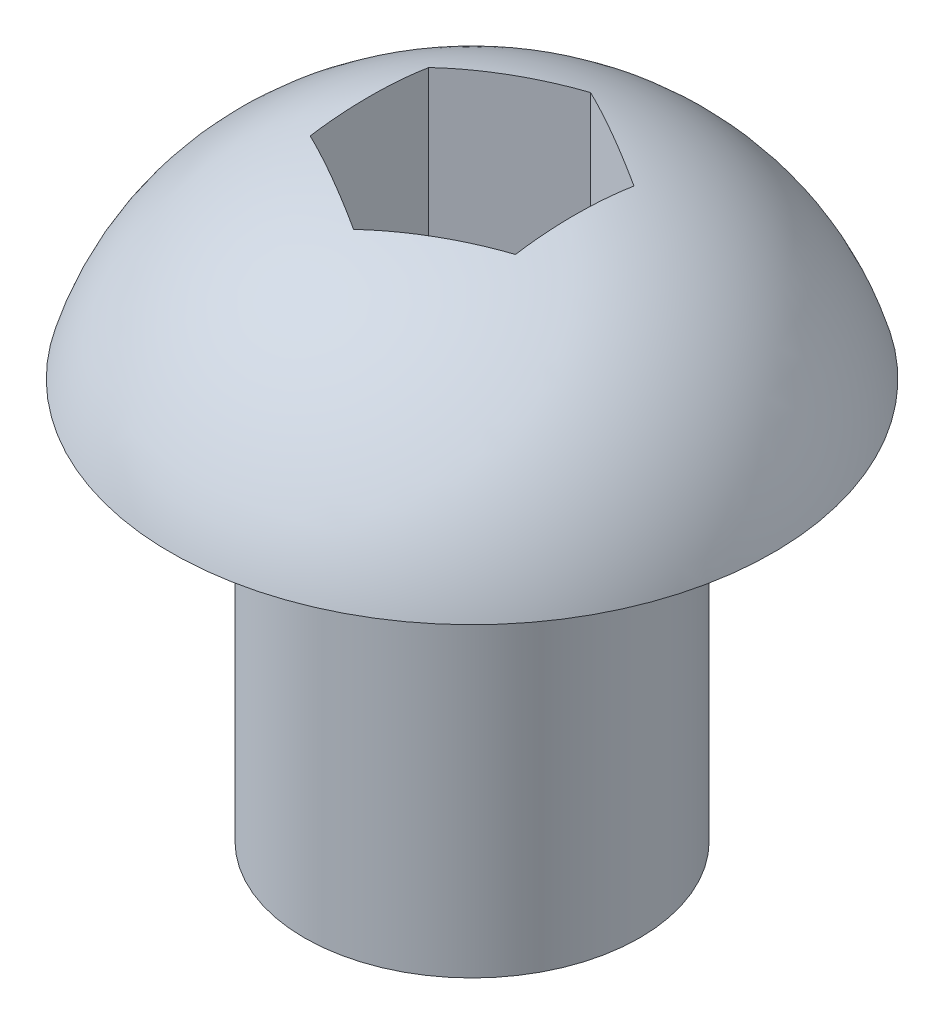
ISO-10303-21;
HEADER;
FILE_DESCRIPTION(('STEP AP214'),'2;1');
FILE_NAME('part.step','',(''),(''),'','','');
FILE_SCHEMA(('AUTOMOTIVE_DESIGN { 1 0 10303 214 1 1 1 1 }'));
ENDSEC;
DATA;
#1=APPLICATION_CONTEXT('core data for automotive mechanical design processes');
#2=APPLICATION_PROTOCOL_DEFINITION('international standard','automotive_design',2000,#1);
#3=PRODUCT_CONTEXT('',#1,'mechanical');
#4=PRODUCT('Part','Part','',(#3));
#5=PRODUCT_RELATED_PRODUCT_CATEGORY('part','',(#4));
#6=PRODUCT_DEFINITION_FORMATION('','',#4);
#7=PRODUCT_DEFINITION_CONTEXT('part definition',#1,'design');
#8=PRODUCT_DEFINITION('design','',#6,#7);
#9=PRODUCT_DEFINITION_SHAPE('','',#8);
#10=(LENGTH_UNIT() NAMED_UNIT(*) SI_UNIT(.MILLI.,.METRE.));
#11=(NAMED_UNIT(*) PLANE_ANGLE_UNIT() SI_UNIT($,.RADIAN.));
#12=(NAMED_UNIT(*) SI_UNIT($,.STERADIAN.) SOLID_ANGLE_UNIT());
#13=UNCERTAINTY_MEASURE_WITH_UNIT(LENGTH_MEASURE(1.E-05),#10,'distance_accuracy_value','');
#14=(GEOMETRIC_REPRESENTATION_CONTEXT(3) GLOBAL_UNCERTAINTY_ASSIGNED_CONTEXT((#13)) GLOBAL_UNIT_ASSIGNED_CONTEXT((#10,
#11,#12)) REPRESENTATION_CONTEXT('',''));
#15=CARTESIAN_POINT('',(0.,0.,0.));
#16=DIRECTION('',(0.,0.,1.));
#17=DIRECTION('',(1.,0.,0.));
#18=AXIS2_PLACEMENT_3D('',#15,#16,#17);
#19=CARTESIAN_POINT('',(2.4257,0.,0.));
#20=DIRECTION('',(0.,-1.,0.));
#21=DIRECTION('',(0.,0.,-1.));
#22=AXIS2_PLACEMENT_3D('',#19,#20,#21);
#23=PLANE('',#22);
#24=CARTESIAN_POINT('',(0.,0.,0.));
#25=DIRECTION('',(0.,-1.,0.));
#26=DIRECTION('',(0.,0.,-1.));
#27=AXIS2_PLACEMENT_3D('',#24,#25,#26);
#28=CIRCLE('',#27,2.4257);
#29=CARTESIAN_POINT('',(0.,0.,-2.4257));
#30=VERTEX_POINT('',#29);
#31=EDGE_CURVE('E123',#30,#30,#28,.T.);
#32=ORIENTED_EDGE('',*,*,#31,.T.);
#33=EDGE_LOOP('',(#32));
#34=FACE_BOUND('',#33,.T.);
#35=ADVANCED_FACE('F36',(#34),#23,.T.);
#36=CARTESIAN_POINT('',(0.,4.69417871693487,0.));
#37=DIRECTION('',(0.,-1.,0.));
#38=DIRECTION('',(0.,0.,-1.));
#39=AXIS2_PLACEMENT_3D('',#36,#37,#38);
#40=DEGENERATE_TOROIDAL_SURFACE('',#39,0.490735937500002,4.01802128306513,.T.);
#41=CARTESIAN_POINT('',(-1.48500055478842,8.52126819752041,0.857134529946162));
#42=CARTESIAN_POINT('',(-1.42345605284962,8.53263218673534,0.892667264707669));
#43=CARTESIAN_POINT('',(-1.36170184009149,8.54243185809129,0.92832107606717));
#44=CARTESIAN_POINT('',(-1.23790653077806,8.55905516785311,0.999794331223692));
#45=CARTESIAN_POINT('',(-1.17586550058913,8.56587946300035,1.03561373670407));
#46=CARTESIAN_POINT('',(-1.05196514152997,8.576677839765,1.10714764235957));
#47=CARTESIAN_POINT('',(-0.990106871712011,8.58066835550609,1.14286153109057));
#48=CARTESIAN_POINT('',(-0.866299165788773,8.58597553249123,1.2143419434331));
#49=CARTESIAN_POINT('',(-0.804349721591492,8.58729194003748,1.25010847171655));
#50=CARTESIAN_POINT('',(-0.680450833196929,8.58729194003748,1.32164152828345));
#51=CARTESIAN_POINT('',(-0.618501388999647,8.58597553249123,1.3574080565669));
#52=CARTESIAN_POINT('',(-0.494693683076409,8.58066835550609,1.42888846890943));
#53=CARTESIAN_POINT('',(-0.432835413258449,8.576677839765,1.46460235764043));
#54=CARTESIAN_POINT('',(-0.308935054199295,8.56587946300035,1.53613626329593));
#55=CARTESIAN_POINT('',(-0.246894024010362,8.55905516785311,1.57195566877631));
#56=CARTESIAN_POINT('',(-0.123098714696933,8.54243185809129,1.64342892393283));
#57=CARTESIAN_POINT('',(-0.0613445019388007,8.53263218673534,1.67908273529233));
#58=CARTESIAN_POINT('',(0.000199999999999774,8.52126819752041,1.71461547005384));
#59=B_SPLINE_CURVE_WITH_KNOTS('',3,(#41,#42,#43,#44,#45,#46,#47,#48,#49,#50,#51,#52,#53,#54,#55,
#56,#57,#58),.UNSPECIFIED.,.F.,.F.,(4,2,2,2,2,2,2,2,4),(0.,0.215876085763593,0.431704498019962,
0.646270787810531,0.860857432969198,1.07544407812787,1.29001036791843,1.5058387801748,
1.7217148659384),.UNSPECIFIED.);
#60=CARTESIAN_POINT('',(-1.48480055478842,8.52130512593453,0.857249999999999));
#61=VERTEX_POINT('',#60);
#62=CARTESIAN_POINT('',(0.,8.52130512593913,1.7145));
#63=VERTEX_POINT('',#62);
#64=EDGE_CURVE('E11',#61,#63,#59,.T.);
#65=ORIENTED_EDGE('',*,*,#64,.F.);
#66=CARTESIAN_POINT('',(-1.48480055478842,6.2540860320131,-3.92194184205145));
#67=CARTESIAN_POINT('',(-1.48480055478842,6.35234420308012,-3.87769530561394));
#68=CARTESIAN_POINT('',(-1.48480055478842,6.44871000577097,-3.82925660286901));
#69=CARTESIAN_POINT('',(-1.48480055478842,6.63699181672535,-3.72441151031348));
#70=CARTESIAN_POINT('',(-1.48480055478842,6.7289083151432,-3.66800600085476));
#71=CARTESIAN_POINT('',(-1.48480055478842,6.90764435131329,-3.54763674639004));
#72=CARTESIAN_POINT('',(-1.48480055478842,6.99446412248751,-3.48367334792815));
#73=CARTESIAN_POINT('',(-1.48480055478842,7.16241359392092,-3.34866912919352));
#74=CARTESIAN_POINT('',(-1.48480055478842,7.24354327974247,-3.27762829096406));
#75=CARTESIAN_POINT('',(-1.48480055478842,7.39954905135694,-3.12901585724702));
#76=CARTESIAN_POINT('',(-1.48480055478842,7.47442641794356,-3.05144560588626));
#77=CARTESIAN_POINT('',(-1.48480055478842,7.61748671327265,-2.89031356794658));
#78=CARTESIAN_POINT('',(-1.48480055478842,7.68566730065923,-2.80674970339852));
#79=CARTESIAN_POINT('',(-1.48480055478842,7.81478961333397,-2.63441221203854));
#80=CARTESIAN_POINT('',(-1.48480055478842,7.87574251005016,-2.54564695064664));
#81=CARTESIAN_POINT('',(-1.48480055478842,7.99020713516254,-2.3634405277781));
#82=CARTESIAN_POINT('',(-1.48480055478842,8.0437185350078,-2.26999916009334));
#83=CARTESIAN_POINT('',(-1.48480055478842,8.14405576080886,-2.07722725655483));
#84=CARTESIAN_POINT('',(-1.48480055478842,8.19072747066138,-1.97781655900659));
#85=CARTESIAN_POINT('',(-1.48480055478842,8.27596140025615,-1.77561304753442));
#86=CARTESIAN_POINT('',(-1.48480055478842,8.31452551799499,-1.67282103171182));
#87=CARTESIAN_POINT('',(-1.48480055478842,8.38368125682067,-1.46432511616571));
#88=CARTESIAN_POINT('',(-1.48480055478842,8.41425367291229,-1.35861486484635));
#89=CARTESIAN_POINT('',(-1.48480055478842,8.4675366873076,-1.14524186718944));
#90=CARTESIAN_POINT('',(-1.48480055478842,8.49024677345088,-1.03757899413663));
#91=CARTESIAN_POINT('',(-1.48480055478842,8.53579824265424,-0.777770909723741));
#92=CARTESIAN_POINT('',(-1.48480055478842,8.55508441996515,-0.624999157088173));
#93=CARTESIAN_POINT('',(-1.48480055478842,8.58069238732413,-0.318319132229824));
#94=CARTESIAN_POINT('',(-1.48480055478842,8.58700440474377,-0.16441009086498));
#95=CARTESIAN_POINT('',(-1.48480055478842,8.58756062004907,0.143467913610971));
#96=CARTESIAN_POINT('',(-1.48480055478842,8.58180180837516,0.297436882094128));
#97=CARTESIAN_POINT('',(-1.48480055478842,8.5573632040929,0.604295470334223));
#98=CARTESIAN_POINT('',(-1.48480055478842,8.53869241737493,0.757185767408363));
#99=CARTESIAN_POINT('',(-1.48480055478842,8.49280269894119,1.02568808548143));
#100=CARTESIAN_POINT('',(-1.48480055478842,8.46852863453429,1.14180332902047));
#101=CARTESIAN_POINT('',(-1.48480055478842,8.41083395035771,1.37175274264053));
#102=CARTESIAN_POINT('',(-1.48480055478842,8.37741393762242,1.48558706357286));
#103=CARTESIAN_POINT('',(-1.48480055478842,8.30124772969897,1.7097869594038));
#104=CARTESIAN_POINT('',(-1.48480055478842,8.25852494987165,1.82016046140334));
#105=CARTESIAN_POINT('',(-1.48480055478842,8.16366833042843,2.0368369375452));
#106=CARTESIAN_POINT('',(-1.48480055478842,8.11153157622265,2.1431386386582));
#107=CARTESIAN_POINT('',(-1.48480055478842,7.99774836729465,2.35123648794121));
#108=CARTESIAN_POINT('',(-1.48480055478842,7.9360548668423,2.45300695367613));
#109=CARTESIAN_POINT('',(-1.48480055478842,7.80371112731108,2.65054561514294));
#110=CARTESIAN_POINT('',(-1.48480055478842,7.7330611437586,2.74631398199687));
#111=CARTESIAN_POINT('',(-1.48480055478842,7.58319624413255,2.93110086695805));
#112=CARTESIAN_POINT('',(-1.48480055478842,7.50397122511524,3.02011120821785));
#113=CARTESIAN_POINT('',(-1.48480055478842,7.33767899789258,3.19041385508771));
#114=CARTESIAN_POINT('',(-1.48480055478842,7.25061283339597,3.2717071849333));
#115=CARTESIAN_POINT('',(-1.48480055478842,7.02324107567918,3.46499804387016));
#116=CARTESIAN_POINT('',(-1.48480055478842,6.87831734219661,3.57167512033847));
#117=CARTESIAN_POINT('',(-1.48480055478842,6.6510798702109,3.71545560019411));
#118=CARTESIAN_POINT('',(-1.48480055478842,6.57375147121738,3.76064977298666));
#119=CARTESIAN_POINT('',(-1.48480055478842,6.41608849913641,3.84549899940108));
#120=CARTESIAN_POINT('',(-1.48480055478842,6.335753185086,3.88515267618989));
#121=CARTESIAN_POINT('',(-1.48480055478842,6.2540860320131,3.92194184205145));
#122=B_SPLINE_CURVE_WITH_KNOTS('',3,(#66,#67,#68,#69,#70,#71,#72,#73,#74,#75,#76,#77,#78,#79,
#80,#81,#82,#83,#84,#85,#86,#87,#88,#89,#90,#91,#92,#93,#94,#95,#96,#97,#98,#99,#100,#101,#102,
#103,#104,#105,#106,#107,#108,#109,#110,#111,#112,#113,#114,#115,#116,#117,#118,#119,#120,#121),
.UNSPECIFIED.,.F.,.F.,(4,2,2,2,2,2,2,2,2,2,2,2,2,2,2,2,2,2,2,2,2,2,2,2,2,2,2,4),(0.,
0.323179929253924,0.646324174223882,0.969453608138817,1.29258386191154,1.61564775890988,
1.93882420777613,2.26149444395808,2.58417892189442,2.9132805060936,3.24230496123598,
3.57211297909923,3.9019424769617,4.36322949108446,4.82486383691124,5.28661329341565,
5.74804101165651,6.10357988249299,6.45909516124311,6.81372573280824,7.16846628772878,
7.525012160703,7.88154786379453,8.23850829962181,8.59542129166232,9.13322783117922,
9.40174347220414,9.67032572209705),.UNSPECIFIED.);
#123=CARTESIAN_POINT('',(-1.48480055478842,8.52130512593913,-0.85725));
#124=VERTEX_POINT('',#123);
#125=EDGE_CURVE('E48',#124,#61,#122,.T.);
#126=ORIENTED_EDGE('',*,*,#125,.F.);
#127=CARTESIAN_POINT('',(0.00020000000000035,8.5212681975204,-1.71461547005384));
#128=CARTESIAN_POINT('',(-0.0613445019387998,8.53263218673534,-1.67908273529233));
#129=CARTESIAN_POINT('',(-0.123098714696932,8.54243185809129,-1.64342892393283));
#130=CARTESIAN_POINT('',(-0.246894024010361,8.55905516785311,-1.57195566877631));
#131=CARTESIAN_POINT('',(-0.308935054199294,8.56587946300035,-1.53613626329593));
#132=CARTESIAN_POINT('',(-0.432835413258449,8.576677839765,-1.46460235764043));
#133=CARTESIAN_POINT('',(-0.494693683076409,8.58066835550609,-1.42888846890943));
#134=CARTESIAN_POINT('',(-0.618501388999647,8.58597553249123,-1.3574080565669));
#135=CARTESIAN_POINT('',(-0.680450833196928,8.58729194003748,-1.32164152828345));
#136=CARTESIAN_POINT('',(-0.804349721591491,8.58729194003748,-1.25010847171655));
#137=CARTESIAN_POINT('',(-0.866299165788773,8.58597553249123,-1.2143419434331));
#138=CARTESIAN_POINT('',(-0.990106871712011,8.58066835550609,-1.14286153109057));
#139=CARTESIAN_POINT('',(-1.05196514152997,8.576677839765,-1.10714764235957));
#140=CARTESIAN_POINT('',(-1.17586550058913,8.56587946300035,-1.03561373670407));
#141=CARTESIAN_POINT('',(-1.23790653077806,8.55905516785311,-0.999794331223692));
#142=CARTESIAN_POINT('',(-1.36170184009149,8.54243185809129,-0.928321076067171));
#143=CARTESIAN_POINT('',(-1.42345605284962,8.53263218673534,-0.89266726470767));
#144=CARTESIAN_POINT('',(-1.48500055478842,8.5212681975204,-0.857134529946162));
#145=B_SPLINE_CURVE_WITH_KNOTS('',3,(#127,#128,#129,#130,#131,#132,#133,#134,#135,#136,#137,
#138,#139,#140,#141,#142,#143,#144),.UNSPECIFIED.,.F.,.F.,(4,2,2,2,2,2,2,2,4),(0.,
0.215876085763593,0.431704498019962,0.646270787810531,0.860857432969198,1.07544407812787,
1.29001036791843,1.5058387801748,1.7217148659384),.UNSPECIFIED.);
#146=CARTESIAN_POINT('',(0.,8.52130512593913,-1.7145));
#147=VERTEX_POINT('',#146);
#148=EDGE_CURVE('E287',#147,#124,#145,.T.);
#149=ORIENTED_EDGE('',*,*,#148,.F.);
#150=CARTESIAN_POINT('',(1.48500055478842,8.52126819752041,-0.857134529946163));
#151=CARTESIAN_POINT('',(1.42345605284962,8.53263218673534,-0.892667264707671));
#152=CARTESIAN_POINT('',(1.36170184009149,8.54243185809129,-0.928321076067172));
#153=CARTESIAN_POINT('',(1.23790653077806,8.55905516785311,-0.999794331223693));
#154=CARTESIAN_POINT('',(1.17586550058912,8.56587946300035,-1.03561373670407));
#155=CARTESIAN_POINT('',(1.05196514152997,8.576677839765,-1.10714764235957));
#156=CARTESIAN_POINT('',(0.99010687171201,8.58066835550609,-1.14286153109057));
#157=CARTESIAN_POINT('',(0.866299165788772,8.58597553249123,-1.2143419434331));
#158=CARTESIAN_POINT('',(0.804349721591491,8.58729194003748,-1.25010847171655));
#159=CARTESIAN_POINT('',(0.680450833196928,8.58729194003748,-1.32164152828345));
#160=CARTESIAN_POINT('',(0.618501388999647,8.58597553249123,-1.3574080565669));
#161=CARTESIAN_POINT('',(0.494693683076409,8.58066835550609,-1.42888846890943));
#162=CARTESIAN_POINT('',(0.432835413258449,8.576677839765,-1.46460235764043));
#163=CARTESIAN_POINT('',(0.308935054199295,8.56587946300035,-1.53613626329593));
#164=CARTESIAN_POINT('',(0.246894024010361,8.55905516785311,-1.57195566877631));
#165=CARTESIAN_POINT('',(0.123098714696933,8.54243185809129,-1.64342892393283));
#166=CARTESIAN_POINT('',(0.0613445019388006,8.53263218673534,-1.67908273529233));
#167=CARTESIAN_POINT('',(-0.000199999999999513,8.5212681975204,-1.71461547005384));
#168=B_SPLINE_CURVE_WITH_KNOTS('',3,(#150,#151,#152,#153,#154,#155,#156,#157,#158,#159,#160,
#161,#162,#163,#164,#165,#166,#167),.UNSPECIFIED.,.F.,.F.,(4,2,2,2,2,2,2,2,4),(0.,
0.215876085763593,0.431704498019961,0.64627078781053,0.860857432969197,1.07544407812786,
1.29001036791843,1.5058387801748,1.72171486593839),.UNSPECIFIED.);
#169=CARTESIAN_POINT('',(1.48480055478842,8.52130512593923,-0.857250000000001));
#170=VERTEX_POINT('',#169);
#171=EDGE_CURVE('E292',#170,#147,#168,.T.);
#172=ORIENTED_EDGE('',*,*,#171,.F.);
#173=CARTESIAN_POINT('',(1.48480055478842,6.2540860320131,3.92194184205146));
#174=CARTESIAN_POINT('',(1.48480055478842,6.35234420308012,3.87769530561394));
#175=CARTESIAN_POINT('',(1.48480055478842,6.44871000577096,3.82925660286901));
#176=CARTESIAN_POINT('',(1.48480055478842,6.63699181672535,3.72441151031348));
#177=CARTESIAN_POINT('',(1.48480055478842,6.7289083151432,3.66800600085476));
#178=CARTESIAN_POINT('',(1.48480055478842,6.90764435131329,3.54763674639005));
#179=CARTESIAN_POINT('',(1.48480055478842,6.99446412248751,3.48367334792815));
#180=CARTESIAN_POINT('',(1.48480055478842,7.16241359392092,3.34866912919352));
#181=CARTESIAN_POINT('',(1.48480055478842,7.24354327974246,3.27762829096407));
#182=CARTESIAN_POINT('',(1.48480055478842,7.39954905135694,3.12901585724702));
#183=CARTESIAN_POINT('',(1.48480055478842,7.47442641794355,3.05144560588626));
#184=CARTESIAN_POINT('',(1.48480055478842,7.61748671327265,2.89031356794659));
#185=CARTESIAN_POINT('',(1.48480055478842,7.68566730065923,2.80674970339853));
#186=CARTESIAN_POINT('',(1.48480055478842,7.81478961333396,2.63441221203854));
#187=CARTESIAN_POINT('',(1.48480055478842,7.87574251005016,2.54564695064664));
#188=CARTESIAN_POINT('',(1.48480055478842,7.99020713516254,2.3634405277781));
#189=CARTESIAN_POINT('',(1.48480055478842,8.0437185350078,2.26999916009334));
#190=CARTESIAN_POINT('',(1.48480055478842,8.14405576080886,2.07722725655483));
#191=CARTESIAN_POINT('',(1.48480055478842,8.19072747066138,1.97781655900659));
#192=CARTESIAN_POINT('',(1.48480055478842,8.27596140025615,1.77561304753442));
#193=CARTESIAN_POINT('',(1.48480055478842,8.31452551799499,1.67282103171182));
#194=CARTESIAN_POINT('',(1.48480055478842,8.38368125682067,1.46432511616572));
#195=CARTESIAN_POINT('',(1.48480055478842,8.41425367291229,1.35861486484636));
#196=CARTESIAN_POINT('',(1.48480055478842,8.4675366873076,1.14524186718944));
#197=CARTESIAN_POINT('',(1.48480055478842,8.49024677345088,1.03757899413663));
#198=CARTESIAN_POINT('',(1.48480055478842,8.53579824265424,0.777770909723745));
#199=CARTESIAN_POINT('',(1.48480055478842,8.55508441996515,0.624999157088176));
#200=CARTESIAN_POINT('',(1.48480055478842,8.58069238732413,0.318319132229828));
#201=CARTESIAN_POINT('',(1.48480055478842,8.58700440474377,0.164410090864984));
#202=CARTESIAN_POINT('',(1.48480055478842,8.58756062004907,-0.143467913610967));
#203=CARTESIAN_POINT('',(1.48480055478842,8.58180180837516,-0.297436882094124));
#204=CARTESIAN_POINT('',(1.48480055478842,8.5573632040929,-0.604295470334219));
#205=CARTESIAN_POINT('',(1.48480055478842,8.53869241737493,-0.757185767408358));
#206=CARTESIAN_POINT('',(1.48480055478842,8.49280269894119,-1.02568808548143));
#207=CARTESIAN_POINT('',(1.48480055478842,8.46852863453429,-1.14180332902047));
#208=CARTESIAN_POINT('',(1.48480055478842,8.41083395035771,-1.37175274264053));
#209=CARTESIAN_POINT('',(1.48480055478842,8.37741393762242,-1.48558706357286));
#210=CARTESIAN_POINT('',(1.48480055478842,8.30124772969898,-1.70978695940379));
#211=CARTESIAN_POINT('',(1.48480055478842,8.25852494987165,-1.82016046140334));
#212=CARTESIAN_POINT('',(1.48480055478842,8.16366833042843,-2.0368369375452));
#213=CARTESIAN_POINT('',(1.48480055478842,8.11153157622265,-2.1431386386582));
#214=CARTESIAN_POINT('',(1.48480055478842,7.99774836729465,-2.35123648794121));
#215=CARTESIAN_POINT('',(1.48480055478842,7.9360548668423,-2.45300695367613));
#216=CARTESIAN_POINT('',(1.48480055478842,7.80371112731108,-2.65054561514293));
#217=CARTESIAN_POINT('',(1.48480055478842,7.7330611437586,-2.74631398199687));
#218=CARTESIAN_POINT('',(1.48480055478842,7.58319624413255,-2.93110086695805));
#219=CARTESIAN_POINT('',(1.48480055478842,7.50397122511524,-3.02011120821784));
#220=CARTESIAN_POINT('',(1.48480055478842,7.33767899789259,-3.19041385508771));
#221=CARTESIAN_POINT('',(1.48480055478842,7.25061283339597,-3.2717071849333));
#222=CARTESIAN_POINT('',(1.48480055478842,7.02324107567919,-3.46499804387016));
#223=CARTESIAN_POINT('',(1.48480055478842,6.87831734219661,-3.57167512033847));
#224=CARTESIAN_POINT('',(1.48480055478842,6.6510798702109,-3.71545560019411));
#225=CARTESIAN_POINT('',(1.48480055478842,6.57375147121738,-3.76064977298666));
#226=CARTESIAN_POINT('',(1.48480055478842,6.4160884991364,-3.84549899940108));
#227=CARTESIAN_POINT('',(1.48480055478842,6.335753185086,-3.88515267618989));
#228=CARTESIAN_POINT('',(1.48480055478842,6.25408603201309,-3.92194184205146));
#229=B_SPLINE_CURVE_WITH_KNOTS('',3,(#173,#174,#175,#176,#177,#178,#179,#180,#181,#182,#183,
#184,#185,#186,#187,#188,#189,#190,#191,#192,#193,#194,#195,#196,#197,#198,#199,#200,#201,#202,
#203,#204,#205,#206,#207,#208,#209,#210,#211,#212,#213,#214,#215,#216,#217,#218,#219,#220,#221,
#222,#223,#224,#225,#226,#227,#228),.UNSPECIFIED.,.F.,.F.,(4,2,2,2,2,2,2,2,2,2,2,2,2,2,2,2,2,2,
2,2,2,2,2,2,2,2,2,4),(0.,0.323179929253925,0.646324174223885,0.969453608138818,1.29258386191154,
1.61564775890988,1.93882420777613,2.26149444395809,2.58417892189443,2.9132805060936,
3.24230496123598,3.57211297909923,3.9019424769617,4.36322949108446,4.82486383691124,
5.28661329341565,5.74804101165652,6.10357988249299,6.45909516124311,6.81372573280824,
7.16846628772878,7.525012160703,7.88154786379454,8.23850829962181,8.59542129166232,
9.13322783117923,9.40174347220415,9.67032572209706),.UNSPECIFIED.);
#230=CARTESIAN_POINT('',(1.48480055478842,8.52130512593913,0.85725));
#231=VERTEX_POINT('',#230);
#232=EDGE_CURVE('E148',#231,#170,#229,.T.);
#233=ORIENTED_EDGE('',*,*,#232,.F.);
#234=CARTESIAN_POINT('',(-0.000200000000000171,8.52126819752041,1.71461547005384));
#235=CARTESIAN_POINT('',(0.0613445019387999,8.53263218673534,1.67908273529233));
#236=CARTESIAN_POINT('',(0.123098714696932,8.54243185809129,1.64342892393283));
#237=CARTESIAN_POINT('',(0.246894024010361,8.55905516785311,1.57195566877631));
#238=CARTESIAN_POINT('',(0.308935054199294,8.56587946300035,1.53613626329593));
#239=CARTESIAN_POINT('',(0.432835413258449,8.576677839765,1.46460235764043));
#240=CARTESIAN_POINT('',(0.494693683076409,8.58066835550609,1.42888846890943));
#241=CARTESIAN_POINT('',(0.618501388999647,8.58597553249123,1.3574080565669));
#242=CARTESIAN_POINT('',(0.680450833196928,8.58729194003748,1.32164152828345));
#243=CARTESIAN_POINT('',(0.804349721591491,8.58729194003748,1.25010847171655));
#244=CARTESIAN_POINT('',(0.866299165788772,8.58597553249123,1.2143419434331));
#245=CARTESIAN_POINT('',(0.99010687171201,8.58066835550609,1.14286153109057));
#246=CARTESIAN_POINT('',(1.05196514152997,8.576677839765,1.10714764235957));
#247=CARTESIAN_POINT('',(1.17586550058912,8.56587946300035,1.03561373670407));
#248=CARTESIAN_POINT('',(1.23790653077806,8.55905516785311,0.999794331223692));
#249=CARTESIAN_POINT('',(1.36170184009149,8.54243185809129,0.92832107606717));
#250=CARTESIAN_POINT('',(1.42345605284962,8.53263218673534,0.892667264707669));
#251=CARTESIAN_POINT('',(1.48500055478842,8.52126819752041,0.857134529946162));
#252=B_SPLINE_CURVE_WITH_KNOTS('',3,(#234,#235,#236,#237,#238,#239,#240,#241,#242,#243,#244,
#245,#246,#247,#248,#249,#250,#251),.UNSPECIFIED.,.F.,.F.,(4,2,2,2,2,2,2,2,4),(0.,
0.215876085763593,0.431704498019962,0.646270787810531,0.860857432969198,1.07544407812786,
1.29001036791843,1.5058387801748,1.7217148659384),.UNSPECIFIED.);
#253=EDGE_CURVE('E141',#63,#231,#252,.T.);
#254=ORIENTED_EDGE('',*,*,#253,.F.);
#255=EDGE_LOOP('',(#65,#126,#149,#172,#233,#254));
#256=FACE_BOUND('',#255,.T.);
#257=CARTESIAN_POINT('',(0.,5.7912,0.));
#258=DIRECTION('',(0.,-1.,0.));
#259=DIRECTION('',(0.,0.,-1.));
#260=AXIS2_PLACEMENT_3D('',#257,#258,#259);
#261=CIRCLE('',#260,4.3561);
#262=CARTESIAN_POINT('',(0.,5.7912,-4.3561));
#263=VERTEX_POINT('',#262);
#264=EDGE_CURVE('E138',#263,#263,#261,.T.);
#265=ORIENTED_EDGE('',*,*,#264,.F.);
#266=EDGE_LOOP('',(#265));
#267=FACE_BOUND('',#266,.T.);
#268=ADVANCED_FACE('F155',(#256,#267),#40,.T.);
#269=CARTESIAN_POINT('',(4.3561,5.7912,0.));
#270=DIRECTION('',(0.,-1.,0.));
#271=DIRECTION('',(0.,0.,-1.));
#272=AXIS2_PLACEMENT_3D('',#269,#270,#271);
#273=PLANE('',#272);
#274=ORIENTED_EDGE('',*,*,#264,.T.);
#275=EDGE_LOOP('',(#274));
#276=FACE_BOUND('',#275,.T.);
#277=CARTESIAN_POINT('',(0.,5.7912,0.));
#278=DIRECTION('',(0.,-1.,0.));
#279=DIRECTION('',(0.,0.,-1.));
#280=AXIS2_PLACEMENT_3D('',#277,#278,#279);
#281=CIRCLE('',#280,2.4257);
#282=CARTESIAN_POINT('',(0.,5.7912,-2.4257));
#283=VERTEX_POINT('',#282);
#284=EDGE_CURVE('E135',#283,#283,#281,.T.);
#285=ORIENTED_EDGE('',*,*,#284,.F.);
#286=EDGE_LOOP('',(#285));
#287=FACE_BOUND('',#286,.T.);
#288=ADVANCED_FACE('F169',(#276,#287),#273,.T.);
#289=CARTESIAN_POINT('',(0.,0.,0.));
#290=DIRECTION('',(0.,-1.,0.));
#291=DIRECTION('',(0.,0.,-1.));
#292=AXIS2_PLACEMENT_3D('',#289,#290,#291);
#293=CYLINDRICAL_SURFACE('',#292,2.4257);
#294=ORIENTED_EDGE('',*,*,#284,.T.);
#295=EDGE_LOOP('',(#294));
#296=FACE_BOUND('',#295,.T.);
#297=ORIENTED_EDGE('',*,*,#31,.F.);
#298=EDGE_LOOP('',(#297));
#299=FACE_BOUND('',#298,.T.);
#300=ADVANCED_FACE('F167',(#296,#299),#293,.T.);
#301=CARTESIAN_POINT('',(-1.48480055478842,6.1722,0.857249999999999));
#302=DIRECTION('',(-0.5,0.,0.866025403784438));
#303=DIRECTION('',(0.866025403784439,0.,0.5));
#304=AXIS2_PLACEMENT_3D('',#301,#302,#303);
#305=PLANE('',#304);
#306=ORIENTED_EDGE('',*,*,#64,.T.);
#307=DIRECTION('',(0.,1.,0.));
#308=VECTOR('',#307,1.);
#309=CARTESIAN_POINT('',(0.,6.1722,1.7145));
#310=LINE('',#309,#308);
#311=CARTESIAN_POINT('',(0.,6.1722,1.7145));
#312=VERTEX_POINT('',#311);
#313=EDGE_CURVE('E55',#312,#63,#310,.T.);
#314=ORIENTED_EDGE('',*,*,#313,.F.);
#315=DIRECTION('',(0.866025403784438,0.,0.5));
#316=VECTOR('',#315,1.);
#317=CARTESIAN_POINT('',(-1.48480055478842,6.1722,0.857249999999999));
#318=LINE('',#317,#316);
#319=CARTESIAN_POINT('',(-1.48480055478842,6.1722,0.857249999999999));
#320=VERTEX_POINT('',#319);
#321=EDGE_CURVE('E93',#320,#312,#318,.T.);
#322=ORIENTED_EDGE('',*,*,#321,.F.);
#323=DIRECTION('',(0.,1.,0.));
#324=VECTOR('',#323,1.);
#325=CARTESIAN_POINT('',(-1.48480055478842,6.1722,0.857249999999999));
#326=LINE('',#325,#324);
#327=EDGE_CURVE('E121',#320,#61,#326,.T.);
#328=ORIENTED_EDGE('',*,*,#327,.T.);
#329=EDGE_LOOP('',(#306,#314,#322,#328));
#330=FACE_BOUND('',#329,.T.);
#331=ADVANCED_FACE('F91',(#330),#305,.F.);
#332=CARTESIAN_POINT('',(-1.48480055478842,6.1722,-0.85725));
#333=DIRECTION('',(-1.,0.,0.));
#334=DIRECTION('',(0.,0.,1.));
#335=AXIS2_PLACEMENT_3D('',#332,#333,#334);
#336=PLANE('',#335);
#337=ORIENTED_EDGE('',*,*,#125,.T.);
#338=ORIENTED_EDGE('',*,*,#327,.F.);
#339=DIRECTION('',(0.,0.,1.));
#340=VECTOR('',#339,1.);
#341=CARTESIAN_POINT('',(-1.48480055478842,6.1722,-0.85725));
#342=LINE('',#341,#340);
#343=CARTESIAN_POINT('',(-1.48480055478842,6.1722,-0.85725));
#344=VERTEX_POINT('',#343);
#345=EDGE_CURVE('E98',#344,#320,#342,.T.);
#346=ORIENTED_EDGE('',*,*,#345,.F.);
#347=DIRECTION('',(0.,1.,0.));
#348=VECTOR('',#347,1.);
#349=CARTESIAN_POINT('',(-1.48480055478842,6.1722,-0.85725));
#350=LINE('',#349,#348);
#351=EDGE_CURVE('E124',#344,#124,#350,.T.);
#352=ORIENTED_EDGE('',*,*,#351,.T.);
#353=EDGE_LOOP('',(#337,#338,#346,#352));
#354=FACE_BOUND('',#353,.T.);
#355=ADVANCED_FACE('F166',(#354),#336,.F.);
#356=CARTESIAN_POINT('',(0.,6.1722,-1.7145));
#357=DIRECTION('',(-0.5,0.,-0.866025403784438));
#358=DIRECTION('',(-0.866025403784439,0.,0.5));
#359=AXIS2_PLACEMENT_3D('',#356,#357,#358);
#360=PLANE('',#359);
#361=ORIENTED_EDGE('',*,*,#148,.T.);
#362=ORIENTED_EDGE('',*,*,#351,.F.);
#363=DIRECTION('',(-0.866025403784439,0.,0.5));
#364=VECTOR('',#363,1.);
#365=CARTESIAN_POINT('',(0.,6.1722,-1.7145));
#366=LINE('',#365,#364);
#367=CARTESIAN_POINT('',(0.,6.1722,-1.7145));
#368=VERTEX_POINT('',#367);
#369=EDGE_CURVE('E118',#368,#344,#366,.T.);
#370=ORIENTED_EDGE('',*,*,#369,.F.);
#371=DIRECTION('',(0.,1.,0.));
#372=VECTOR('',#371,1.);
#373=CARTESIAN_POINT('',(0.,6.1722,-1.7145));
#374=LINE('',#373,#372);
#375=EDGE_CURVE('E126',#368,#147,#374,.T.);
#376=ORIENTED_EDGE('',*,*,#375,.T.);
#377=EDGE_LOOP('',(#361,#362,#370,#376));
#378=FACE_BOUND('',#377,.T.);
#379=ADVANCED_FACE('F209',(#378),#360,.F.);
#380=CARTESIAN_POINT('',(1.48480055478842,6.1722,-0.857250000000001));
#381=DIRECTION('',(0.5,0.,-0.866025403784439));
#382=DIRECTION('',(-0.866025403784438,0.,-0.5));
#383=AXIS2_PLACEMENT_3D('',#380,#381,#382);
#384=PLANE('',#383);
#385=ORIENTED_EDGE('',*,*,#171,.T.);
#386=ORIENTED_EDGE('',*,*,#375,.F.);
#387=DIRECTION('',(-0.866025403784438,0.,-0.5));
#388=VECTOR('',#387,1.);
#389=CARTESIAN_POINT('',(1.48480055478842,6.1722,-0.857250000000001));
#390=LINE('',#389,#388);
#391=CARTESIAN_POINT('',(1.48480055478842,6.1722,-0.857250000000001));
#392=VERTEX_POINT('',#391);
#393=EDGE_CURVE('E115',#392,#368,#390,.T.);
#394=ORIENTED_EDGE('',*,*,#393,.F.);
#395=DIRECTION('',(0.,1.,0.));
#396=VECTOR('',#395,1.);
#397=CARTESIAN_POINT('',(1.48480055478842,6.1722,-0.857250000000001));
#398=LINE('',#397,#396);
#399=EDGE_CURVE('E129',#392,#170,#398,.T.);
#400=ORIENTED_EDGE('',*,*,#399,.T.);
#401=EDGE_LOOP('',(#385,#386,#394,#400));
#402=FACE_BOUND('',#401,.T.);
#403=ADVANCED_FACE('F219',(#402),#384,.F.);
#404=CARTESIAN_POINT('',(1.48480055478842,6.1722,0.85725));
#405=DIRECTION('',(1.,0.,0.));
#406=DIRECTION('',(0.,0.,-1.));
#407=AXIS2_PLACEMENT_3D('',#404,#405,#406);
#408=PLANE('',#407);
#409=ORIENTED_EDGE('',*,*,#232,.T.);
#410=ORIENTED_EDGE('',*,*,#399,.F.);
#411=DIRECTION('',(0.,0.,-1.));
#412=VECTOR('',#411,1.);
#413=CARTESIAN_POINT('',(1.48480055478842,6.1722,0.85725));
#414=LINE('',#413,#412);
#415=CARTESIAN_POINT('',(1.48480055478842,6.1722,0.85725));
#416=VERTEX_POINT('',#415);
#417=EDGE_CURVE('E107',#416,#392,#414,.T.);
#418=ORIENTED_EDGE('',*,*,#417,.F.);
#419=DIRECTION('',(0.,1.,0.));
#420=VECTOR('',#419,1.);
#421=CARTESIAN_POINT('',(1.48480055478842,6.1722,0.85725));
#422=LINE('',#421,#420);
#423=EDGE_CURVE('E97',#416,#231,#422,.T.);
#424=ORIENTED_EDGE('',*,*,#423,.T.);
#425=EDGE_LOOP('',(#409,#410,#418,#424));
#426=FACE_BOUND('',#425,.T.);
#427=ADVANCED_FACE('F160',(#426),#408,.F.);
#428=CARTESIAN_POINT('',(0.,6.1722,1.7145));
#429=DIRECTION('',(0.5,0.,0.866025403784438));
#430=DIRECTION('',(0.866025403784438,0.,-0.5));
#431=AXIS2_PLACEMENT_3D('',#428,#429,#430);
#432=PLANE('',#431);
#433=ORIENTED_EDGE('',*,*,#253,.T.);
#434=ORIENTED_EDGE('',*,*,#423,.F.);
#435=DIRECTION('',(0.866025403784438,0.,-0.5));
#436=VECTOR('',#435,1.);
#437=CARTESIAN_POINT('',(0.,6.1722,1.7145));
#438=LINE('',#437,#436);
#439=EDGE_CURVE('E101',#312,#416,#438,.T.);
#440=ORIENTED_EDGE('',*,*,#439,.F.);
#441=ORIENTED_EDGE('',*,*,#313,.T.);
#442=EDGE_LOOP('',(#433,#434,#440,#441));
#443=FACE_BOUND('',#442,.T.);
#444=ADVANCED_FACE('F102',(#443),#432,.F.);
#445=CARTESIAN_POINT('',(0.,6.1722,0.));
#446=DIRECTION('',(0.,1.,0.));
#447=DIRECTION('',(0.,0.,1.));
#448=AXIS2_PLACEMENT_3D('',#445,#446,#447);
#449=PLANE('',#448);
#450=ORIENTED_EDGE('',*,*,#321,.T.);
#451=ORIENTED_EDGE('',*,*,#439,.T.);
#452=ORIENTED_EDGE('',*,*,#417,.T.);
#453=ORIENTED_EDGE('',*,*,#393,.T.);
#454=ORIENTED_EDGE('',*,*,#369,.T.);
#455=ORIENTED_EDGE('',*,*,#345,.T.);
#456=EDGE_LOOP('',(#450,#451,#452,#453,#454,#455));
#457=FACE_BOUND('',#456,.T.);
#458=ADVANCED_FACE('F109',(#457),#449,.T.);
#459=CLOSED_SHELL('',(#35,#268,#288,#300,#331,#355,#379,#403,#427,#444,#458));
#460=MANIFOLD_SOLID_BREP('B2',#459);
#461=ADVANCED_BREP_SHAPE_REPRESENTATION('',(#18,#460),#14);
#462=SHAPE_DEFINITION_REPRESENTATION(#9,#461);
ENDSEC;
END-ISO-10303-21;
